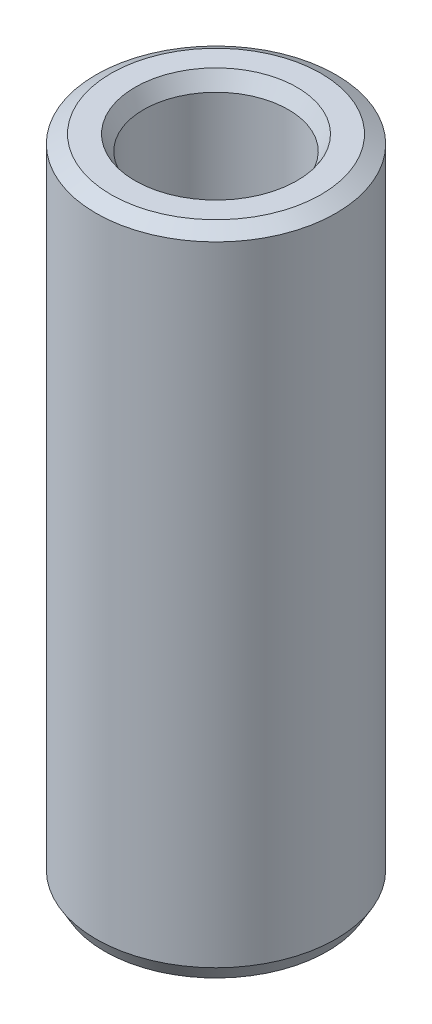
ISO-10303-21;
HEADER;
FILE_DESCRIPTION(('STEP AP214'),'2;1');
FILE_NAME('part.step','',(''),(''),'','','');
FILE_SCHEMA(('AUTOMOTIVE_DESIGN { 1 0 10303 214 1 1 1 1 }'));
ENDSEC;
DATA;
#1=APPLICATION_CONTEXT('core data for automotive mechanical design processes');
#2=APPLICATION_PROTOCOL_DEFINITION('international standard','automotive_design',2000,#1);
#3=PRODUCT_CONTEXT('',#1,'mechanical');
#4=PRODUCT('Part','Part','',(#3));
#5=PRODUCT_RELATED_PRODUCT_CATEGORY('part','',(#4));
#6=PRODUCT_DEFINITION_FORMATION('','',#4);
#7=PRODUCT_DEFINITION_CONTEXT('part definition',#1,'design');
#8=PRODUCT_DEFINITION('design','',#6,#7);
#9=PRODUCT_DEFINITION_SHAPE('','',#8);
#10=(LENGTH_UNIT() NAMED_UNIT(*) SI_UNIT(.MILLI.,.METRE.));
#11=(NAMED_UNIT(*) PLANE_ANGLE_UNIT() SI_UNIT($,.RADIAN.));
#12=(NAMED_UNIT(*) SI_UNIT($,.STERADIAN.) SOLID_ANGLE_UNIT());
#13=UNCERTAINTY_MEASURE_WITH_UNIT(LENGTH_MEASURE(1.E-05),#10,'distance_accuracy_value','');
#14=(GEOMETRIC_REPRESENTATION_CONTEXT(3) GLOBAL_UNCERTAINTY_ASSIGNED_CONTEXT((#13)) GLOBAL_UNIT_ASSIGNED_CONTEXT((#10,
#11,#12)) REPRESENTATION_CONTEXT('',''));
#15=CARTESIAN_POINT('',(0.,0.,0.));
#16=DIRECTION('',(0.,0.,1.));
#17=DIRECTION('',(1.,0.,0.));
#18=AXIS2_PLACEMENT_3D('',#15,#16,#17);
#19=CARTESIAN_POINT('',(0.,108.701334121004,0.));
#20=DIRECTION('',(0.,-1.,0.));
#21=DIRECTION('',(0.,0.,-1.));
#22=AXIS2_PLACEMENT_3D('',#19,#20,#21);
#23=CYLINDRICAL_SURFACE('',#22,20.);
#24=CARTESIAN_POINT('',(0.,2.49784540754068,0.));
#25=DIRECTION('',(0.,1.,0.));
#26=DIRECTION('',(0.,0.,1.));
#27=AXIS2_PLACEMENT_3D('',#24,#25,#26);
#28=CIRCLE('',#27,20.);
#29=CARTESIAN_POINT('',(0.,2.49784540754068,20.));
#30=VERTEX_POINT('',#29);
#31=EDGE_CURVE('E10',#30,#30,#28,.T.);
#32=ORIENTED_EDGE('',*,*,#31,.T.);
#33=EDGE_LOOP('',(#32));
#34=FACE_BOUND('',#33,.T.);
#35=CARTESIAN_POINT('',(0.,107.259202402566,0.));
#36=DIRECTION('',(0.,1.,0.));
#37=DIRECTION('',(0.,0.,1.));
#38=AXIS2_PLACEMENT_3D('',#35,#36,#37);
#39=CIRCLE('',#38,20.);
#40=CARTESIAN_POINT('',(0.,107.259202402566,-20.));
#41=VERTEX_POINT('',#40);
#42=EDGE_CURVE('E50',#41,#41,#39,.F.);
#43=ORIENTED_EDGE('',*,*,#42,.T.);
#44=EDGE_LOOP('',(#43));
#45=FACE_BOUND('',#44,.T.);
#46=ADVANCED_FACE('F39',(#34,#45),#23,.T.);
#47=CARTESIAN_POINT('',(0.,108.701334121004,0.));
#48=DIRECTION('',(0.,1.,0.));
#49=DIRECTION('',(0.,0.,1.));
#50=AXIS2_PLACEMENT_3D('',#47,#48,#49);
#51=PLANE('',#50);
#52=CARTESIAN_POINT('',(0.,108.701334121004,0.));
#53=DIRECTION('',(0.,1.,0.));
#54=DIRECTION('',(0.,0.,1.));
#55=AXIS2_PLACEMENT_3D('',#52,#53,#54);
#56=CIRCLE('',#55,13.4963739449817);
#57=CARTESIAN_POINT('',(0.,108.701334121004,13.4963739449817));
#58=VERTEX_POINT('',#57);
#59=EDGE_CURVE('E58',#58,#58,#56,.F.);
#60=ORIENTED_EDGE('',*,*,#59,.T.);
#61=EDGE_LOOP('',(#60));
#62=FACE_BOUND('',#61,.T.);
#63=CARTESIAN_POINT('',(0.,108.701334121004,0.));
#64=DIRECTION('',(0.,1.,0.));
#65=DIRECTION('',(0.,0.,1.));
#66=AXIS2_PLACEMENT_3D('',#63,#64,#65);
#67=CIRCLE('',#66,17.5021545924592);
#68=CARTESIAN_POINT('',(0.,108.701334121004,-17.5021545924593));
#69=VERTEX_POINT('',#68);
#70=EDGE_CURVE('E61',#69,#69,#67,.T.);
#71=ORIENTED_EDGE('',*,*,#70,.T.);
#72=EDGE_LOOP('',(#71));
#73=FACE_BOUND('',#72,.T.);
#74=ADVANCED_FACE('F88',(#62,#73),#51,.T.);
#75=CARTESIAN_POINT('',(0.,0.,0.));
#76=DIRECTION('',(0.,1.,0.));
#77=DIRECTION('',(0.,0.,1.));
#78=AXIS2_PLACEMENT_3D('',#75,#76,#77);
#79=PLANE('',#78);
#80=CARTESIAN_POINT('',(0.,0.,0.));
#81=DIRECTION('',(0.,1.,0.));
#82=DIRECTION('',(0.,0.,1.));
#83=AXIS2_PLACEMENT_3D('',#80,#81,#82);
#84=CIRCLE('',#83,14.5520876340847);
#85=CARTESIAN_POINT('',(0.,0.,14.5520876340847));
#86=VERTEX_POINT('',#85);
#87=EDGE_CURVE('E51',#86,#86,#84,.T.);
#88=ORIENTED_EDGE('',*,*,#87,.T.);
#89=EDGE_LOOP('',(#88));
#90=FACE_BOUND('',#89,.T.);
#91=CARTESIAN_POINT('',(0.,0.,0.));
#92=DIRECTION('',(0.,1.,0.));
#93=DIRECTION('',(0.,0.,1.));
#94=AXIS2_PLACEMENT_3D('',#91,#92,#93);
#95=CIRCLE('',#94,18.5578682815623);
#96=CARTESIAN_POINT('',(0.,0.,18.5578682815623));
#97=VERTEX_POINT('',#96);
#98=EDGE_CURVE('E54',#97,#97,#95,.F.);
#99=ORIENTED_EDGE('',*,*,#98,.T.);
#100=EDGE_LOOP('',(#99));
#101=FACE_BOUND('',#100,.T.);
#102=ADVANCED_FACE('F83',(#90,#101),#79,.F.);
#103=CARTESIAN_POINT('',(0.,108.701334121004,0.));
#104=DIRECTION('',(0.,-1.,0.));
#105=DIRECTION('',(0.,0.,-1.));
#106=AXIS2_PLACEMENT_3D('',#103,#104,#105);
#107=CYLINDRICAL_SURFACE('',#106,12.054242226544);
#108=CARTESIAN_POINT('',(0.,106.203488713463,0.));
#109=DIRECTION('',(0.,1.,0.));
#110=DIRECTION('',(0.,0.,1.));
#111=AXIS2_PLACEMENT_3D('',#108,#109,#110);
#112=CIRCLE('',#111,12.054242226544);
#113=CARTESIAN_POINT('',(0.,106.203488713463,12.054242226544));
#114=VERTEX_POINT('',#113);
#115=EDGE_CURVE('E67',#114,#114,#112,.T.);
#116=ORIENTED_EDGE('',*,*,#115,.T.);
#117=EDGE_LOOP('',(#116));
#118=FACE_BOUND('',#117,.T.);
#119=CARTESIAN_POINT('',(0.,1.44213171843773,0.));
#120=DIRECTION('',(0.,1.,0.));
#121=DIRECTION('',(0.,0.,1.));
#122=AXIS2_PLACEMENT_3D('',#119,#120,#121);
#123=CIRCLE('',#122,12.054242226544);
#124=CARTESIAN_POINT('',(0.,1.44213171843773,12.054242226544));
#125=VERTEX_POINT('',#124);
#126=EDGE_CURVE('E69',#125,#125,#123,.F.);
#127=ORIENTED_EDGE('',*,*,#126,.T.);
#128=EDGE_LOOP('',(#127));
#129=FACE_BOUND('',#128,.T.);
#130=ADVANCED_FACE('F71',(#118,#129),#107,.F.);
#131=CARTESIAN_POINT('',(0.,106.203488713463,0.));
#132=DIRECTION('',(0.,1.,0.));
#133=DIRECTION('',(0.,0.,1.));
#134=AXIS2_PLACEMENT_3D('',#131,#132,#133);
#135=CONICAL_SURFACE('',#134,12.054242226544,0.523598775598296);
#136=ORIENTED_EDGE('',*,*,#59,.F.);
#137=EDGE_LOOP('',(#136));
#138=FACE_BOUND('',#137,.T.);
#139=ORIENTED_EDGE('',*,*,#115,.F.);
#140=EDGE_LOOP('',(#139));
#141=FACE_BOUND('',#140,.T.);
#142=ADVANCED_FACE('F77',(#138,#141),#135,.F.);
#143=CARTESIAN_POINT('',(0.,0.,0.));
#144=DIRECTION('',(0.,-1.,0.));
#145=DIRECTION('',(0.,0.,-1.));
#146=AXIS2_PLACEMENT_3D('',#143,#144,#145);
#147=CONICAL_SURFACE('',#146,14.5520876340847,1.04719755119659);
#148=ORIENTED_EDGE('',*,*,#126,.F.);
#149=EDGE_LOOP('',(#148));
#150=FACE_BOUND('',#149,.T.);
#151=ORIENTED_EDGE('',*,*,#87,.F.);
#152=EDGE_LOOP('',(#151));
#153=FACE_BOUND('',#152,.T.);
#154=ADVANCED_FACE('F73',(#150,#153),#147,.F.);
#155=CARTESIAN_POINT('',(0.,2.49784540754068,0.));
#156=DIRECTION('',(0.,1.,0.));
#157=DIRECTION('',(0.,0.,1.));
#158=AXIS2_PLACEMENT_3D('',#155,#156,#157);
#159=CONICAL_SURFACE('',#158,20.,0.523598775598302);
#160=ORIENTED_EDGE('',*,*,#98,.F.);
#161=EDGE_LOOP('',(#160));
#162=FACE_BOUND('',#161,.T.);
#163=ORIENTED_EDGE('',*,*,#31,.F.);
#164=EDGE_LOOP('',(#163));
#165=FACE_BOUND('',#164,.T.);
#166=ADVANCED_FACE('F76',(#162,#165),#159,.T.);
#167=CARTESIAN_POINT('',(0.,108.701334121004,0.));
#168=DIRECTION('',(0.,-1.,0.));
#169=DIRECTION('',(0.,0.,-1.));
#170=AXIS2_PLACEMENT_3D('',#167,#168,#169);
#171=CONICAL_SURFACE('',#170,17.5021545924592,1.04719755119659);
#172=CARTESIAN_POINT('',(0.,107.259202402566,-20.));
#173=CARTESIAN_POINT('',(0.,107.274224607967,-19.9739807770048));
#174=CARTESIAN_POINT('',(0.,107.289246813367,-19.9479615540096));
#175=CARTESIAN_POINT('',(0.,107.319291224168,-19.8959231080191));
#176=CARTESIAN_POINT('',(0.,107.334313429568,-19.8699038850239));
#177=CARTESIAN_POINT('',(0.,107.364357840369,-19.8178654390335));
#178=CARTESIAN_POINT('',(0.,107.379380045769,-19.7918462160383));
#179=CARTESIAN_POINT('',(0.,107.40942445657,-19.7398077700479));
#180=CARTESIAN_POINT('',(0.,107.424446661971,-19.7137885470526));
#181=CARTESIAN_POINT('',(0.,107.454491072771,-19.6617501010622));
#182=CARTESIAN_POINT('',(0.,107.469513278172,-19.635730878067));
#183=CARTESIAN_POINT('',(0.,107.499557688972,-19.5836924320766));
#184=CARTESIAN_POINT('',(0.,107.514579894373,-19.5576732090813));
#185=CARTESIAN_POINT('',(0.,107.544624305174,-19.5056347630909));
#186=CARTESIAN_POINT('',(0.,107.559646510574,-19.4796155400957));
#187=CARTESIAN_POINT('',(0.,107.589690921375,-19.4275770941053));
#188=CARTESIAN_POINT('',(0.,107.604713126775,-19.40155787111));
#189=CARTESIAN_POINT('',(0.,107.634757537576,-19.3495194251196));
#190=CARTESIAN_POINT('',(0.,107.649779742976,-19.3235002021244));
#191=CARTESIAN_POINT('',(0.,107.679824153777,-19.271461756134));
#192=CARTESIAN_POINT('',(0.,107.694846359178,-19.2454425331387));
#193=CARTESIAN_POINT('',(0.,107.724890769978,-19.1934040871483));
#194=CARTESIAN_POINT('',(0.,107.739912975379,-19.1673848641531));
#195=CARTESIAN_POINT('',(0.,107.76995738618,-19.1153464181627));
#196=CARTESIAN_POINT('',(0.,107.78497959158,-19.0893271951674));
#197=CARTESIAN_POINT('',(0.,107.815024002381,-19.037288749177));
#198=CARTESIAN_POINT('',(0.,107.830046207781,-19.0112695261818));
#199=CARTESIAN_POINT('',(0.,107.860090618582,-18.9592310801914));
#200=CARTESIAN_POINT('',(0.,107.875112823982,-18.9332118571961));
#201=CARTESIAN_POINT('',(0.,107.905157234783,-18.8811734112057));
#202=CARTESIAN_POINT('',(0.,107.920179440183,-18.8551541882105));
#203=CARTESIAN_POINT('',(0.,107.950223850984,-18.8031157422201));
#204=CARTESIAN_POINT('',(0.,107.965246056385,-18.7770965192248));
#205=CARTESIAN_POINT('',(0.,107.995290467185,-18.7250580732344));
#206=CARTESIAN_POINT('',(0.,108.010312672586,-18.6990388502392));
#207=CARTESIAN_POINT('',(0.,108.040357083387,-18.6470004042488));
#208=CARTESIAN_POINT('',(0.,108.055379288787,-18.6209811812536));
#209=CARTESIAN_POINT('',(0.,108.085423699588,-18.5689427352631));
#210=CARTESIAN_POINT('',(0.,108.100445904988,-18.5429235122679));
#211=CARTESIAN_POINT('',(0.,108.130490315789,-18.4908850662775));
#212=CARTESIAN_POINT('',(0.,108.145512521189,-18.4648658432823));
#213=CARTESIAN_POINT('',(0.,108.17555693199,-18.4128273972918));
#214=CARTESIAN_POINT('',(0.,108.190579137391,-18.3868081742966));
#215=CARTESIAN_POINT('',(0.,108.220623548191,-18.3347697283062));
#216=CARTESIAN_POINT('',(0.,108.235645753592,-18.308750505311));
#217=CARTESIAN_POINT('',(0.,108.265690164393,-18.2567120593205));
#218=CARTESIAN_POINT('',(0.,108.280712369793,-18.2306928363253));
#219=CARTESIAN_POINT('',(0.,108.310756780594,-18.1786543903349));
#220=CARTESIAN_POINT('',(0.,108.325778985994,-18.1526351673397));
#221=CARTESIAN_POINT('',(0.,108.355823396795,-18.1005967213492));
#222=CARTESIAN_POINT('',(0.,108.370845602195,-18.074577498354));
#223=CARTESIAN_POINT('',(0.,108.400890012996,-18.0225390523636));
#224=CARTESIAN_POINT('',(0.,108.415912218396,-17.9965198293684));
#225=CARTESIAN_POINT('',(0.,108.445956629197,-17.9444813833779));
#226=CARTESIAN_POINT('',(0.,108.460978834598,-17.9184621603827));
#227=CARTESIAN_POINT('',(0.,108.491023245398,-17.8664237143923));
#228=CARTESIAN_POINT('',(0.,108.506045450799,-17.8404044913971));
#229=CARTESIAN_POINT('',(0.,108.5360898616,-17.7883660454066));
#230=CARTESIAN_POINT('',(0.,108.551112067,-17.7623468224114));
#231=CARTESIAN_POINT('',(0.,108.581156477801,-17.710308376421));
#232=CARTESIAN_POINT('',(0.,108.596178683201,-17.6842891534258));
#233=CARTESIAN_POINT('',(0.,108.626223094002,-17.6322507074353));
#234=CARTESIAN_POINT('',(0.,108.641245299402,-17.6062314844401));
#235=CARTESIAN_POINT('',(0.,108.671289710203,-17.5541930384497));
#236=CARTESIAN_POINT('',(0.,108.686311915604,-17.5281738154545));
#237=CARTESIAN_POINT('',(0.,108.701334121004,-17.5021545924593));
#238=B_SPLINE_CURVE_WITH_KNOTS('',3,(#172,#173,#174,#175,#176,#177,#178,#179,#180,#181,#182,
#183,#184,#185,#186,#187,#188,#189,#190,#191,#192,#193,#194,#195,#196,#197,#198,#199,#200,#201,
#202,#203,#204,#205,#206,#207,#208,#209,#210,#211,#212,#213,#214,#215,#216,#217,#218,#219,#220,
#221,#222,#223,#224,#225,#226,#227,#228,#229,#230,#231,#232,#233,#234,#235,#236,#237),
.UNSPECIFIED.,.F.,.F.,(4,2,2,2,2,2,2,2,2,2,2,2,2,2,2,2,2,2,2,2,2,2,2,2,2,2,2,2,2,2,2,2,4),(0.,
0.0901332324023623,0.180266464804722,0.270399697207081,0.360532929609436,0.450666162011796,
0.540799394414155,0.63093262681651,0.72106585921887,0.811199091621229,0.901332324023585,
0.991465556425944,1.08159878882831,1.17173202123066,1.26186525363302,1.35199848603538,
1.44213171843773,1.53226495084009,1.62239818324245,1.71253141564481,1.80266464804717,
1.89279788044953,1.98293111285189,2.07306434525424,2.1631975776566,2.25333081005896,
2.34346404246131,2.43359727486368,2.52373050726603,2.61386373966839,2.70399697207075,
2.79413020447311,2.88426343687547),.UNSPECIFIED.);
#239=EDGE_CURVE('BSEAM45',#41,#69,#238,.T.);
#240=ORIENTED_EDGE('',*,*,#42,.F.);
#241=ORIENTED_EDGE('',*,*,#70,.F.);
#242=ORIENTED_EDGE('',*,*,#239,.T.);
#243=ORIENTED_EDGE('',*,*,#239,.F.);
#244=EDGE_LOOP('',(#240,#242,#241,#243));
#245=FACE_BOUND('',#244,.T.);
#246=ADVANCED_FACE('F45',(#245),#171,.T.);
#247=CLOSED_SHELL('',(#46,#74,#102,#130,#142,#154,#166,#246));
#248=MANIFOLD_SOLID_BREP('B2',#247);
#249=ADVANCED_BREP_SHAPE_REPRESENTATION('',(#18,#248),#14);
#250=SHAPE_DEFINITION_REPRESENTATION(#9,#249);
ENDSEC;
END-ISO-10303-21;
